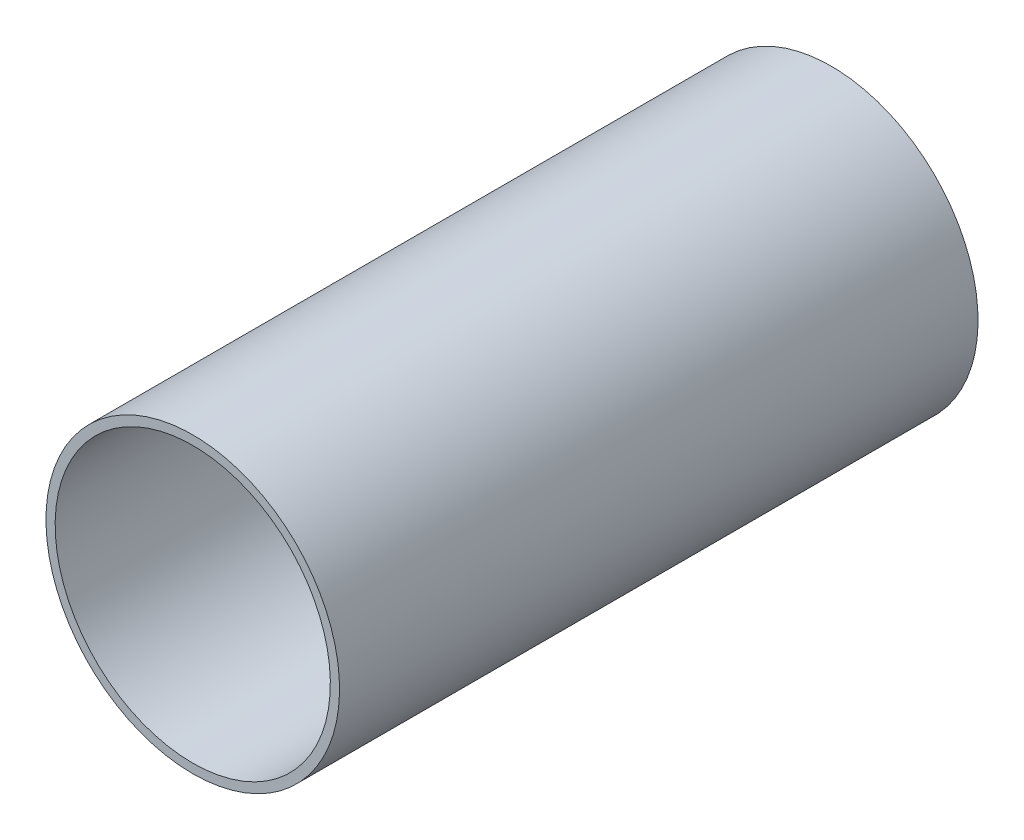
ISO-10303-21;
HEADER;
FILE_DESCRIPTION(('STEP AP214'),'2;1');
FILE_NAME('part.step','',(''),(''),'','','');
FILE_SCHEMA(('AUTOMOTIVE_DESIGN { 1 0 10303 214 1 1 1 1 }'));
ENDSEC;
DATA;
#1=APPLICATION_CONTEXT('core data for automotive mechanical design processes');
#2=APPLICATION_PROTOCOL_DEFINITION('international standard','automotive_design',2000,#1);
#3=PRODUCT_CONTEXT('',#1,'mechanical');
#4=PRODUCT('Part','Part','',(#3));
#5=PRODUCT_RELATED_PRODUCT_CATEGORY('part','',(#4));
#6=PRODUCT_DEFINITION_FORMATION('','',#4);
#7=PRODUCT_DEFINITION_CONTEXT('part definition',#1,'design');
#8=PRODUCT_DEFINITION('design','',#6,#7);
#9=PRODUCT_DEFINITION_SHAPE('','',#8);
#10=(LENGTH_UNIT() NAMED_UNIT(*) SI_UNIT(.MILLI.,.METRE.));
#11=(NAMED_UNIT(*) PLANE_ANGLE_UNIT() SI_UNIT($,.RADIAN.));
#12=(NAMED_UNIT(*) SI_UNIT($,.STERADIAN.) SOLID_ANGLE_UNIT());
#13=UNCERTAINTY_MEASURE_WITH_UNIT(LENGTH_MEASURE(1.E-05),#10,'distance_accuracy_value','');
#14=(GEOMETRIC_REPRESENTATION_CONTEXT(3) GLOBAL_UNCERTAINTY_ASSIGNED_CONTEXT((#13)) GLOBAL_UNIT_ASSIGNED_CONTEXT((#10,
#11,#12)) REPRESENTATION_CONTEXT('',''));
#15=CARTESIAN_POINT('',(0.,0.,0.));
#16=DIRECTION('',(0.,0.,1.));
#17=DIRECTION('',(1.,0.,0.));
#18=AXIS2_PLACEMENT_3D('',#15,#16,#17);
#19=CARTESIAN_POINT('',(154.94,-80.772,-0.045));
#20=DIRECTION('',(0.,0.,-1.));
#21=DIRECTION('',(0.,-1.,0.));
#22=AXIS2_PLACEMENT_3D('',#19,#20,#21);
#23=CYLINDRICAL_SURFACE('',#22,0.375);
#24=CARTESIAN_POINT('',(154.94,-80.772,-0.035));
#25=DIRECTION('',(0.,0.,-1.));
#26=DIRECTION('',(0.,-1.,0.));
#27=AXIS2_PLACEMENT_3D('',#24,#25,#26);
#28=CIRCLE('',#27,0.375);
#29=CARTESIAN_POINT('',(154.94,-81.147,-0.035));
#30=VERTEX_POINT('',#29);
#31=EDGE_CURVE('E64',#30,#30,#28,.T.);
#32=ORIENTED_EDGE('',*,*,#31,.T.);
#33=DIRECTION('',(0.,0.,1.));
#34=VECTOR('',#33,1.);
#35=CARTESIAN_POINT('',(154.94,-81.147,-0.045));
#36=LINE('',#35,#34);
#37=CARTESIAN_POINT('',(154.94,-81.147,1.705));
#38=VERTEX_POINT('',#37);
#39=EDGE_CURVE('E11',#30,#38,#36,.T.);
#40=ORIENTED_EDGE('',*,*,#39,.T.);
#41=CARTESIAN_POINT('',(154.94,-80.772,1.705));
#42=DIRECTION('',(0.,0.,-1.));
#43=DIRECTION('',(0.,-1.,0.));
#44=AXIS2_PLACEMENT_3D('',#41,#42,#43);
#45=CIRCLE('',#44,0.375);
#46=EDGE_CURVE('E25',#38,#38,#45,.T.);
#47=ORIENTED_EDGE('',*,*,#46,.F.);
#48=ORIENTED_EDGE('',*,*,#39,.F.);
#49=EDGE_LOOP('',(#32,#40,#47,#48));
#50=FACE_BOUND('',#49,.T.);
#51=ADVANCED_FACE('F17',(#50),#23,.F.);
#52=CARTESIAN_POINT('',(154.94,-81.172,1.705));
#53=DIRECTION('',(0.,0.,1.));
#54=DIRECTION('',(1.,0.,0.));
#55=AXIS2_PLACEMENT_3D('',#52,#53,#54);
#56=PLANE('',#55);
#57=ORIENTED_EDGE('',*,*,#46,.T.);
#58=EDGE_LOOP('',(#57));
#59=FACE_BOUND('',#58,.T.);
#60=CARTESIAN_POINT('',(154.94,-80.772,1.705));
#61=DIRECTION('',(0.,0.,1.));
#62=DIRECTION('',(0.,-1.,0.));
#63=AXIS2_PLACEMENT_3D('',#60,#61,#62);
#64=CIRCLE('',#63,0.4);
#65=CARTESIAN_POINT('',(154.94,-81.172,1.705));
#66=VERTEX_POINT('',#65);
#67=EDGE_CURVE('E56',#66,#66,#64,.T.);
#68=ORIENTED_EDGE('',*,*,#67,.T.);
#69=EDGE_LOOP('',(#68));
#70=FACE_BOUND('',#69,.T.);
#71=ADVANCED_FACE('F73',(#59,#70),#56,.T.);
#72=CARTESIAN_POINT('',(154.94,-81.172,-0.035));
#73=DIRECTION('',(0.,0.,1.));
#74=DIRECTION('',(1.,0.,0.));
#75=AXIS2_PLACEMENT_3D('',#72,#73,#74);
#76=PLANE('',#75);
#77=ORIENTED_EDGE('',*,*,#31,.F.);
#78=EDGE_LOOP('',(#77));
#79=FACE_BOUND('',#78,.T.);
#80=CARTESIAN_POINT('',(154.94,-80.772,-0.035));
#81=DIRECTION('',(0.,0.,1.));
#82=DIRECTION('',(0.,-1.,0.));
#83=AXIS2_PLACEMENT_3D('',#80,#81,#82);
#84=CIRCLE('',#83,0.4);
#85=CARTESIAN_POINT('',(154.94,-81.172,-0.035));
#86=VERTEX_POINT('',#85);
#87=EDGE_CURVE('E55',#86,#86,#84,.T.);
#88=ORIENTED_EDGE('',*,*,#87,.F.);
#89=EDGE_LOOP('',(#88));
#90=FACE_BOUND('',#89,.T.);
#91=ADVANCED_FACE('F82',(#79,#90),#76,.F.);
#92=CARTESIAN_POINT('',(154.94,-80.772,-0.035));
#93=DIRECTION('',(0.,0.,-1.));
#94=DIRECTION('',(0.,-1.,0.));
#95=AXIS2_PLACEMENT_3D('',#92,#93,#94);
#96=CYLINDRICAL_SURFACE('',#95,0.4);
#97=ORIENTED_EDGE('',*,*,#87,.T.);
#98=DIRECTION('',(0.,0.,1.));
#99=VECTOR('',#98,1.);
#100=CARTESIAN_POINT('',(154.94,-81.172,-0.035));
#101=LINE('',#100,#99);
#102=EDGE_CURVE('E52',#86,#66,#101,.T.);
#103=ORIENTED_EDGE('',*,*,#102,.T.);
#104=ORIENTED_EDGE('',*,*,#67,.F.);
#105=ORIENTED_EDGE('',*,*,#102,.F.);
#106=EDGE_LOOP('',(#97,#103,#104,#105));
#107=FACE_BOUND('',#106,.T.);
#108=ADVANCED_FACE('F53',(#107),#96,.T.);
#109=CLOSED_SHELL('',(#51,#71,#91,#108));
#110=MANIFOLD_SOLID_BREP('B1',#109);
#111=ADVANCED_BREP_SHAPE_REPRESENTATION('',(#18,#110),#14);
#112=SHAPE_DEFINITION_REPRESENTATION(#9,#111);
ENDSEC;
END-ISO-10303-21;
